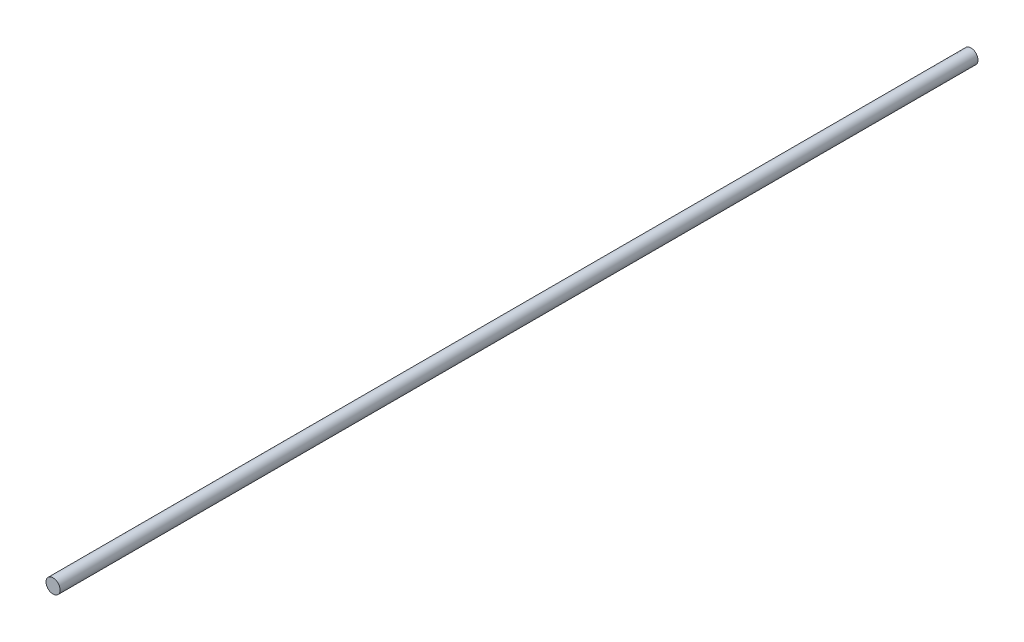
ISO-10303-21;
HEADER;
FILE_DESCRIPTION(('STEP AP214'),'2;1');
FILE_NAME('part.step','',(''),(''),'','','');
FILE_SCHEMA(('AUTOMOTIVE_DESIGN { 1 0 10303 214 1 1 1 1 }'));
ENDSEC;
DATA;
#1=APPLICATION_CONTEXT('core data for automotive mechanical design processes');
#2=APPLICATION_PROTOCOL_DEFINITION('international standard','automotive_design',2000,#1);
#3=PRODUCT_CONTEXT('',#1,'mechanical');
#4=PRODUCT('Part','Part','',(#3));
#5=PRODUCT_RELATED_PRODUCT_CATEGORY('part','',(#4));
#6=PRODUCT_DEFINITION_FORMATION('','',#4);
#7=PRODUCT_DEFINITION_CONTEXT('part definition',#1,'design');
#8=PRODUCT_DEFINITION('design','',#6,#7);
#9=PRODUCT_DEFINITION_SHAPE('','',#8);
#10=(LENGTH_UNIT() NAMED_UNIT(*) SI_UNIT(.MILLI.,.METRE.));
#11=(NAMED_UNIT(*) PLANE_ANGLE_UNIT() SI_UNIT($,.RADIAN.));
#12=(NAMED_UNIT(*) SI_UNIT($,.STERADIAN.) SOLID_ANGLE_UNIT());
#13=UNCERTAINTY_MEASURE_WITH_UNIT(LENGTH_MEASURE(1.E-05),#10,'distance_accuracy_value','');
#14=(GEOMETRIC_REPRESENTATION_CONTEXT(3) GLOBAL_UNCERTAINTY_ASSIGNED_CONTEXT((#13)) GLOBAL_UNIT_ASSIGNED_CONTEXT((#10,
#11,#12)) REPRESENTATION_CONTEXT('',''));
#15=CARTESIAN_POINT('',(0.,0.,0.));
#16=DIRECTION('',(0.,0.,1.));
#17=DIRECTION('',(1.,0.,0.));
#18=AXIS2_PLACEMENT_3D('',#15,#16,#17);
#19=CARTESIAN_POINT('',(0.,0.,520.));
#20=DIRECTION('',(0.,0.,-1.));
#21=DIRECTION('',(-1.,0.,0.));
#22=AXIS2_PLACEMENT_3D('',#19,#20,#21);
#23=CYLINDRICAL_SURFACE('',#22,4.);
#24=CARTESIAN_POINT('',(0.,0.,520.));
#25=DIRECTION('',(0.,0.,1.));
#26=DIRECTION('',(1.,0.,0.));
#27=AXIS2_PLACEMENT_3D('',#24,#25,#26);
#28=CIRCLE('',#27,4.);
#29=CARTESIAN_POINT('',(4.,0.,520.));
#30=VERTEX_POINT('',#29);
#31=EDGE_CURVE('E10',#30,#30,#28,.T.);
#32=ORIENTED_EDGE('',*,*,#31,.F.);
#33=EDGE_LOOP('',(#32));
#34=FACE_BOUND('',#33,.T.);
#35=CARTESIAN_POINT('',(0.,0.,0.));
#36=DIRECTION('',(0.,0.,1.));
#37=DIRECTION('',(1.,0.,0.));
#38=AXIS2_PLACEMENT_3D('',#35,#36,#37);
#39=CIRCLE('',#38,4.);
#40=CARTESIAN_POINT('',(4.,0.,0.));
#41=VERTEX_POINT('',#40);
#42=EDGE_CURVE('E34',#41,#41,#39,.T.);
#43=ORIENTED_EDGE('',*,*,#42,.T.);
#44=EDGE_LOOP('',(#43));
#45=FACE_BOUND('',#44,.T.);
#46=ADVANCED_FACE('F31',(#34,#45),#23,.T.);
#47=CARTESIAN_POINT('',(0.,0.,520.));
#48=DIRECTION('',(0.,0.,1.));
#49=DIRECTION('',(1.,0.,0.));
#50=AXIS2_PLACEMENT_3D('',#47,#48,#49);
#51=PLANE('',#50);
#52=ORIENTED_EDGE('',*,*,#31,.T.);
#53=EDGE_LOOP('',(#52));
#54=FACE_BOUND('',#53,.T.);
#55=ADVANCED_FACE('F46',(#54),#51,.T.);
#56=CARTESIAN_POINT('',(0.,0.,0.));
#57=DIRECTION('',(0.,0.,1.));
#58=DIRECTION('',(1.,0.,0.));
#59=AXIS2_PLACEMENT_3D('',#56,#57,#58);
#60=PLANE('',#59);
#61=ORIENTED_EDGE('',*,*,#42,.F.);
#62=EDGE_LOOP('',(#61));
#63=FACE_BOUND('',#62,.T.);
#64=ADVANCED_FACE('F44',(#63),#60,.F.);
#65=CLOSED_SHELL('',(#46,#55,#64));
#66=MANIFOLD_SOLID_BREP('B2',#65);
#67=ADVANCED_BREP_SHAPE_REPRESENTATION('',(#18,#66),#14);
#68=SHAPE_DEFINITION_REPRESENTATION(#9,#67);
ENDSEC;
END-ISO-10303-21;
